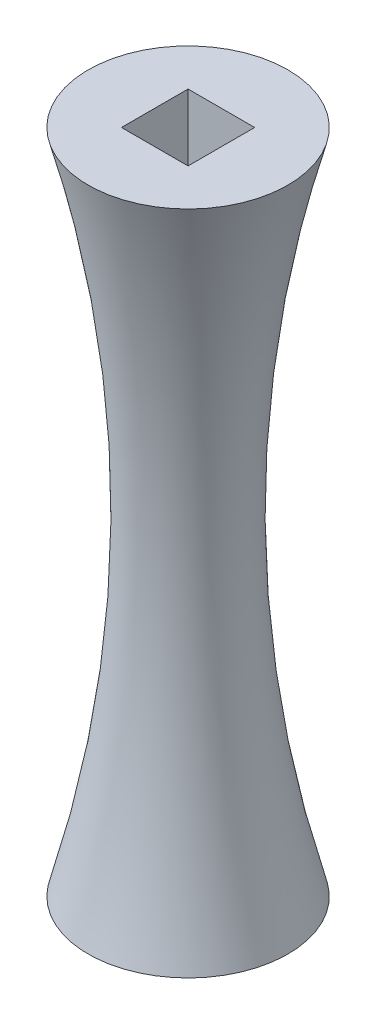
ISO-10303-21;
HEADER;
FILE_DESCRIPTION(('STEP AP214'),'2;1');
FILE_NAME('part.step','',(''),(''),'','','');
FILE_SCHEMA(('AUTOMOTIVE_DESIGN { 1 0 10303 214 1 1 1 1 }'));
ENDSEC;
DATA;
#1=APPLICATION_CONTEXT('core data for automotive mechanical design processes');
#2=APPLICATION_PROTOCOL_DEFINITION('international standard','automotive_design',2000,#1);
#3=PRODUCT_CONTEXT('',#1,'mechanical');
#4=PRODUCT('Part','Part','',(#3));
#5=PRODUCT_RELATED_PRODUCT_CATEGORY('part','',(#4));
#6=PRODUCT_DEFINITION_FORMATION('','',#4);
#7=PRODUCT_DEFINITION_CONTEXT('part definition',#1,'design');
#8=PRODUCT_DEFINITION('design','',#6,#7);
#9=PRODUCT_DEFINITION_SHAPE('','',#8);
#10=(LENGTH_UNIT() NAMED_UNIT(*) SI_UNIT(.MILLI.,.METRE.));
#11=(NAMED_UNIT(*) PLANE_ANGLE_UNIT() SI_UNIT($,.RADIAN.));
#12=(NAMED_UNIT(*) SI_UNIT($,.STERADIAN.) SOLID_ANGLE_UNIT());
#13=UNCERTAINTY_MEASURE_WITH_UNIT(LENGTH_MEASURE(1.E-05),#10,'distance_accuracy_value','');
#14=(GEOMETRIC_REPRESENTATION_CONTEXT(3) GLOBAL_UNCERTAINTY_ASSIGNED_CONTEXT((#13)) GLOBAL_UNIT_ASSIGNED_CONTEXT((#10,
#11,#12)) REPRESENTATION_CONTEXT('',''));
#15=CARTESIAN_POINT('',(0.,0.,0.));
#16=DIRECTION('',(0.,0.,1.));
#17=DIRECTION('',(1.,0.,0.));
#18=AXIS2_PLACEMENT_3D('',#15,#16,#17);
#19=CARTESIAN_POINT('',(0.,50.,0.));
#20=DIRECTION('',(0.,1.,0.));
#21=DIRECTION('',(0.,0.,1.));
#22=AXIS2_PLACEMENT_3D('',#19,#20,#21);
#23=PLANE('',#22);
#24=DIRECTION('',(0.,0.,-1.));
#25=VECTOR('',#24,1.);
#26=CARTESIAN_POINT('',(2.5,50.,-2.5));
#27=LINE('',#26,#25);
#28=CARTESIAN_POINT('',(2.5,50.,2.5));
#29=VERTEX_POINT('',#28);
#30=CARTESIAN_POINT('',(2.5,50.,-2.5));
#31=VERTEX_POINT('',#30);
#32=EDGE_CURVE('E60',#29,#31,#27,.T.);
#33=ORIENTED_EDGE('',*,*,#32,.F.);
#34=DIRECTION('',(1.,0.,0.));
#35=VECTOR('',#34,1.);
#36=CARTESIAN_POINT('',(-2.5,50.,2.5));
#37=LINE('',#36,#35);
#38=CARTESIAN_POINT('',(-2.5,50.,2.5));
#39=VERTEX_POINT('',#38);
#40=EDGE_CURVE('E147',#39,#29,#37,.T.);
#41=ORIENTED_EDGE('',*,*,#40,.F.);
#42=DIRECTION('',(0.,0.,1.));
#43=VECTOR('',#42,1.);
#44=CARTESIAN_POINT('',(-2.5,50.,-2.5));
#45=LINE('',#44,#43);
#46=CARTESIAN_POINT('',(-2.5,50.,-2.5));
#47=VERTEX_POINT('',#46);
#48=EDGE_CURVE('E160',#47,#39,#45,.T.);
#49=ORIENTED_EDGE('',*,*,#48,.F.);
#50=DIRECTION('',(-1.,0.,0.));
#51=VECTOR('',#50,1.);
#52=CARTESIAN_POINT('',(-2.5,50.,-2.5));
#53=LINE('',#52,#51);
#54=EDGE_CURVE('E157',#31,#47,#53,.T.);
#55=ORIENTED_EDGE('',*,*,#54,.F.);
#56=EDGE_LOOP('',(#33,#41,#49,#55));
#57=FACE_BOUND('',#56,.T.);
#58=CARTESIAN_POINT('',(0.,50.,0.));
#59=DIRECTION('',(0.,-1.,0.));
#60=DIRECTION('',(0.,0.,-1.));
#61=AXIS2_PLACEMENT_3D('',#58,#59,#60);
#62=CIRCLE('',#61,7.5);
#63=CARTESIAN_POINT('',(0.,50.,-7.5));
#64=VERTEX_POINT('',#63);
#65=EDGE_CURVE('E220',#64,#64,#62,.T.);
#66=ORIENTED_EDGE('',*,*,#65,.F.);
#67=EDGE_LOOP('',(#66));
#68=FACE_BOUND('',#67,.T.);
#69=ADVANCED_FACE('F36',(#57,#68),#23,.T.);
#70=CARTESIAN_POINT('',(2.5,40.,-2.5));
#71=DIRECTION('',(1.,0.,0.));
#72=DIRECTION('',(0.,0.,-1.));
#73=AXIS2_PLACEMENT_3D('',#70,#71,#72);
#74=PLANE('',#73);
#75=ORIENTED_EDGE('',*,*,#32,.T.);
#76=DIRECTION('',(0.,1.,0.));
#77=VECTOR('',#76,1.);
#78=CARTESIAN_POINT('',(2.5,40.,-2.5));
#79=LINE('',#78,#77);
#80=CARTESIAN_POINT('',(2.5,40.,-2.5));
#81=VERTEX_POINT('',#80);
#82=EDGE_CURVE('E40',#81,#31,#79,.T.);
#83=ORIENTED_EDGE('',*,*,#82,.F.);
#84=DIRECTION('',(0.,0.,-1.));
#85=VECTOR('',#84,1.);
#86=CARTESIAN_POINT('',(2.5,40.,-2.5));
#87=LINE('',#86,#85);
#88=CARTESIAN_POINT('',(2.5,40.,2.5));
#89=VERTEX_POINT('',#88);
#90=EDGE_CURVE('E143',#89,#81,#87,.T.);
#91=ORIENTED_EDGE('',*,*,#90,.F.);
#92=DIRECTION('',(0.,1.,0.));
#93=VECTOR('',#92,1.);
#94=CARTESIAN_POINT('',(2.5,40.,2.5));
#95=LINE('',#94,#93);
#96=EDGE_CURVE('E11',#89,#29,#95,.T.);
#97=ORIENTED_EDGE('',*,*,#96,.T.);
#98=EDGE_LOOP('',(#75,#83,#91,#97));
#99=FACE_BOUND('',#98,.T.);
#100=ADVANCED_FACE('F183',(#99),#74,.F.);
#101=CARTESIAN_POINT('',(-2.5,40.,2.5));
#102=DIRECTION('',(0.,0.,1.));
#103=DIRECTION('',(1.,0.,0.));
#104=AXIS2_PLACEMENT_3D('',#101,#102,#103);
#105=PLANE('',#104);
#106=ORIENTED_EDGE('',*,*,#40,.T.);
#107=ORIENTED_EDGE('',*,*,#96,.F.);
#108=DIRECTION('',(1.,0.,0.));
#109=VECTOR('',#108,1.);
#110=CARTESIAN_POINT('',(-2.5,40.,2.5));
#111=LINE('',#110,#109);
#112=CARTESIAN_POINT('',(-2.5,40.,2.5));
#113=VERTEX_POINT('',#112);
#114=EDGE_CURVE('E153',#113,#89,#111,.T.);
#115=ORIENTED_EDGE('',*,*,#114,.F.);
#116=DIRECTION('',(0.,1.,0.));
#117=VECTOR('',#116,1.);
#118=CARTESIAN_POINT('',(-2.5,40.,2.5));
#119=LINE('',#118,#117);
#120=EDGE_CURVE('E45',#113,#39,#119,.T.);
#121=ORIENTED_EDGE('',*,*,#120,.T.);
#122=EDGE_LOOP('',(#106,#107,#115,#121));
#123=FACE_BOUND('',#122,.T.);
#124=ADVANCED_FACE('F182',(#123),#105,.F.);
#125=CARTESIAN_POINT('',(-2.5,40.,-2.5));
#126=DIRECTION('',(-1.,0.,0.));
#127=DIRECTION('',(0.,0.,1.));
#128=AXIS2_PLACEMENT_3D('',#125,#126,#127);
#129=PLANE('',#128);
#130=ORIENTED_EDGE('',*,*,#48,.T.);
#131=ORIENTED_EDGE('',*,*,#120,.F.);
#132=DIRECTION('',(0.,0.,1.));
#133=VECTOR('',#132,1.);
#134=CARTESIAN_POINT('',(-2.5,40.,-2.5));
#135=LINE('',#134,#133);
#136=CARTESIAN_POINT('',(-2.5,40.,-2.5));
#137=VERTEX_POINT('',#136);
#138=EDGE_CURVE('E150',#137,#113,#135,.T.);
#139=ORIENTED_EDGE('',*,*,#138,.F.);
#140=DIRECTION('',(0.,1.,0.));
#141=VECTOR('',#140,1.);
#142=CARTESIAN_POINT('',(-2.5,40.,-2.5));
#143=LINE('',#142,#141);
#144=EDGE_CURVE('E165',#137,#47,#143,.T.);
#145=ORIENTED_EDGE('',*,*,#144,.T.);
#146=EDGE_LOOP('',(#130,#131,#139,#145));
#147=FACE_BOUND('',#146,.T.);
#148=ADVANCED_FACE('F177',(#147),#129,.F.);
#149=CARTESIAN_POINT('',(-2.5,40.,-2.5));
#150=DIRECTION('',(0.,0.,-1.));
#151=DIRECTION('',(-1.,0.,0.));
#152=AXIS2_PLACEMENT_3D('',#149,#150,#151);
#153=PLANE('',#152);
#154=ORIENTED_EDGE('',*,*,#54,.T.);
#155=ORIENTED_EDGE('',*,*,#144,.F.);
#156=DIRECTION('',(-1.,0.,0.));
#157=VECTOR('',#156,1.);
#158=CARTESIAN_POINT('',(-2.5,40.,-2.5));
#159=LINE('',#158,#157);
#160=EDGE_CURVE('E146',#81,#137,#159,.T.);
#161=ORIENTED_EDGE('',*,*,#160,.F.);
#162=ORIENTED_EDGE('',*,*,#82,.T.);
#163=EDGE_LOOP('',(#154,#155,#161,#162));
#164=FACE_BOUND('',#163,.T.);
#165=ADVANCED_FACE('F171',(#164),#153,.F.);
#166=CARTESIAN_POINT('',(0.,40.,0.));
#167=DIRECTION('',(0.,1.,0.));
#168=DIRECTION('',(0.,0.,1.));
#169=AXIS2_PLACEMENT_3D('',#166,#167,#168);
#170=PLANE('',#169);
#171=ORIENTED_EDGE('',*,*,#90,.T.);
#172=ORIENTED_EDGE('',*,*,#160,.T.);
#173=ORIENTED_EDGE('',*,*,#138,.T.);
#174=ORIENTED_EDGE('',*,*,#114,.T.);
#175=EDGE_LOOP('',(#171,#172,#173,#174));
#176=FACE_BOUND('',#175,.T.);
#177=ADVANCED_FACE('F181',(#176),#170,.T.);
#178=CARTESIAN_POINT('',(0.,25.,0.));
#179=DIRECTION('',(0.,-1.,0.));
#180=DIRECTION('',(0.,0.,-1.));
#181=AXIS2_PLACEMENT_3D('',#178,#179,#180);
#182=TOROIDAL_SURFACE('',#181,97.5,93.407708461347);
#183=ORIENTED_EDGE('',*,*,#65,.T.);
#184=EDGE_LOOP('',(#183));
#185=FACE_BOUND('',#184,.T.);
#186=CARTESIAN_POINT('',(0.,0.,0.));
#187=DIRECTION('',(0.,-1.,0.));
#188=DIRECTION('',(0.,0.,-1.));
#189=AXIS2_PLACEMENT_3D('',#186,#187,#188);
#190=CIRCLE('',#189,7.5);
#191=CARTESIAN_POINT('',(0.,0.,-7.5));
#192=VERTEX_POINT('',#191);
#193=EDGE_CURVE('E128',#192,#192,#190,.T.);
#194=ORIENTED_EDGE('',*,*,#193,.F.);
#195=EDGE_LOOP('',(#194));
#196=FACE_BOUND('',#195,.T.);
#197=ADVANCED_FACE('F198',(#185,#196),#182,.F.);
#198=CARTESIAN_POINT('',(0.,10.,0.));
#199=DIRECTION('',(0.,-1.,0.));
#200=DIRECTION('',(0.,0.,-1.));
#201=AXIS2_PLACEMENT_3D('',#198,#199,#200);
#202=PLANE('',#201);
#203=DIRECTION('',(0.,0.,-1.));
#204=VECTOR('',#203,1.);
#205=CARTESIAN_POINT('',(-2.5,10.,2.5));
#206=LINE('',#205,#204);
#207=CARTESIAN_POINT('',(-2.5,10.,2.5));
#208=VERTEX_POINT('',#207);
#209=CARTESIAN_POINT('',(-2.5,10.,-2.5));
#210=VERTEX_POINT('',#209);
#211=EDGE_CURVE('E104',#208,#210,#206,.T.);
#212=ORIENTED_EDGE('',*,*,#211,.T.);
#213=DIRECTION('',(1.,0.,0.));
#214=VECTOR('',#213,1.);
#215=CARTESIAN_POINT('',(-2.5,10.,-2.5));
#216=LINE('',#215,#214);
#217=CARTESIAN_POINT('',(2.5,10.,-2.5));
#218=VERTEX_POINT('',#217);
#219=EDGE_CURVE('E113',#210,#218,#216,.T.);
#220=ORIENTED_EDGE('',*,*,#219,.T.);
#221=DIRECTION('',(0.,0.,1.));
#222=VECTOR('',#221,1.);
#223=CARTESIAN_POINT('',(2.5,10.,2.5));
#224=LINE('',#223,#222);
#225=CARTESIAN_POINT('',(2.5,10.,2.5));
#226=VERTEX_POINT('',#225);
#227=EDGE_CURVE('E118',#218,#226,#224,.T.);
#228=ORIENTED_EDGE('',*,*,#227,.T.);
#229=DIRECTION('',(-1.,0.,0.));
#230=VECTOR('',#229,1.);
#231=CARTESIAN_POINT('',(-2.5,10.,2.5));
#232=LINE('',#231,#230);
#233=EDGE_CURVE('E110',#226,#208,#232,.T.);
#234=ORIENTED_EDGE('',*,*,#233,.T.);
#235=EDGE_LOOP('',(#212,#220,#228,#234));
#236=FACE_BOUND('',#235,.T.);
#237=ADVANCED_FACE('F120',(#236),#202,.T.);
#238=CARTESIAN_POINT('',(2.5,10.,2.5));
#239=DIRECTION('',(1.,0.,0.));
#240=DIRECTION('',(0.,0.,-1.));
#241=AXIS2_PLACEMENT_3D('',#238,#239,#240);
#242=PLANE('',#241);
#243=DIRECTION('',(0.,0.,1.));
#244=VECTOR('',#243,1.);
#245=CARTESIAN_POINT('',(2.5,0.,2.5));
#246=LINE('',#245,#244);
#247=CARTESIAN_POINT('',(2.5,0.,-2.5));
#248=VERTEX_POINT('',#247);
#249=CARTESIAN_POINT('',(2.5,0.,2.5));
#250=VERTEX_POINT('',#249);
#251=EDGE_CURVE('E125',#248,#250,#246,.T.);
#252=ORIENTED_EDGE('',*,*,#251,.T.);
#253=DIRECTION('',(0.,-1.,0.));
#254=VECTOR('',#253,1.);
#255=CARTESIAN_POINT('',(2.5,10.,2.5));
#256=LINE('',#255,#254);
#257=EDGE_CURVE('E140',#226,#250,#256,.T.);
#258=ORIENTED_EDGE('',*,*,#257,.F.);
#259=ORIENTED_EDGE('',*,*,#227,.F.);
#260=DIRECTION('',(0.,-1.,0.));
#261=VECTOR('',#260,1.);
#262=CARTESIAN_POINT('',(2.5,10.,-2.5));
#263=LINE('',#262,#261);
#264=EDGE_CURVE('E109',#218,#248,#263,.T.);
#265=ORIENTED_EDGE('',*,*,#264,.T.);
#266=EDGE_LOOP('',(#252,#258,#259,#265));
#267=FACE_BOUND('',#266,.T.);
#268=ADVANCED_FACE('F204',(#267),#242,.F.);
#269=CARTESIAN_POINT('',(-2.5,10.,2.5));
#270=DIRECTION('',(0.,0.,1.));
#271=DIRECTION('',(1.,0.,0.));
#272=AXIS2_PLACEMENT_3D('',#269,#270,#271);
#273=PLANE('',#272);
#274=DIRECTION('',(-1.,0.,0.));
#275=VECTOR('',#274,1.);
#276=CARTESIAN_POINT('',(-2.5,0.,2.5));
#277=LINE('',#276,#275);
#278=CARTESIAN_POINT('',(-2.5,0.,2.5));
#279=VERTEX_POINT('',#278);
#280=EDGE_CURVE('E122',#250,#279,#277,.T.);
#281=ORIENTED_EDGE('',*,*,#280,.T.);
#282=DIRECTION('',(0.,-1.,0.));
#283=VECTOR('',#282,1.);
#284=CARTESIAN_POINT('',(-2.5,10.,2.5));
#285=LINE('',#284,#283);
#286=EDGE_CURVE('E138',#208,#279,#285,.T.);
#287=ORIENTED_EDGE('',*,*,#286,.F.);
#288=ORIENTED_EDGE('',*,*,#233,.F.);
#289=ORIENTED_EDGE('',*,*,#257,.T.);
#290=EDGE_LOOP('',(#281,#287,#288,#289));
#291=FACE_BOUND('',#290,.T.);
#292=ADVANCED_FACE('F201',(#291),#273,.F.);
#293=CARTESIAN_POINT('',(-2.5,10.,2.5));
#294=DIRECTION('',(-1.,0.,0.));
#295=DIRECTION('',(0.,0.,1.));
#296=AXIS2_PLACEMENT_3D('',#293,#294,#295);
#297=PLANE('',#296);
#298=DIRECTION('',(0.,0.,-1.));
#299=VECTOR('',#298,1.);
#300=CARTESIAN_POINT('',(-2.5,0.,2.5));
#301=LINE('',#300,#299);
#302=CARTESIAN_POINT('',(-2.5,0.,-2.5));
#303=VERTEX_POINT('',#302);
#304=EDGE_CURVE('E53',#279,#303,#301,.T.);
#305=ORIENTED_EDGE('',*,*,#304,.T.);
#306=DIRECTION('',(0.,-1.,0.));
#307=VECTOR('',#306,1.);
#308=CARTESIAN_POINT('',(-2.5,10.,-2.5));
#309=LINE('',#308,#307);
#310=EDGE_CURVE('E100',#210,#303,#309,.T.);
#311=ORIENTED_EDGE('',*,*,#310,.F.);
#312=ORIENTED_EDGE('',*,*,#211,.F.);
#313=ORIENTED_EDGE('',*,*,#286,.T.);
#314=EDGE_LOOP('',(#305,#311,#312,#313));
#315=FACE_BOUND('',#314,.T.);
#316=ADVANCED_FACE('F102',(#315),#297,.F.);
#317=CARTESIAN_POINT('',(-2.5,10.,-2.5));
#318=DIRECTION('',(0.,0.,-1.));
#319=DIRECTION('',(-1.,0.,0.));
#320=AXIS2_PLACEMENT_3D('',#317,#318,#319);
#321=PLANE('',#320);
#322=DIRECTION('',(1.,0.,0.));
#323=VECTOR('',#322,1.);
#324=CARTESIAN_POINT('',(-2.5,0.,-2.5));
#325=LINE('',#324,#323);
#326=EDGE_CURVE('E134',#303,#248,#325,.T.);
#327=ORIENTED_EDGE('',*,*,#326,.T.);
#328=ORIENTED_EDGE('',*,*,#264,.F.);
#329=ORIENTED_EDGE('',*,*,#219,.F.);
#330=ORIENTED_EDGE('',*,*,#310,.T.);
#331=EDGE_LOOP('',(#327,#328,#329,#330));
#332=FACE_BOUND('',#331,.T.);
#333=ADVANCED_FACE('F114',(#332),#321,.F.);
#334=CARTESIAN_POINT('',(0.,0.,0.));
#335=DIRECTION('',(0.,1.,0.));
#336=DIRECTION('',(0.,0.,1.));
#337=AXIS2_PLACEMENT_3D('',#334,#335,#336);
#338=PLANE('',#337);
#339=ORIENTED_EDGE('',*,*,#326,.F.);
#340=ORIENTED_EDGE('',*,*,#304,.F.);
#341=ORIENTED_EDGE('',*,*,#280,.F.);
#342=ORIENTED_EDGE('',*,*,#251,.F.);
#343=EDGE_LOOP('',(#339,#340,#341,#342));
#344=FACE_BOUND('',#343,.T.);
#345=ORIENTED_EDGE('',*,*,#193,.T.);
#346=EDGE_LOOP('',(#345));
#347=FACE_BOUND('',#346,.T.);
#348=ADVANCED_FACE('F38',(#344,#347),#338,.F.);
#349=CLOSED_SHELL('',(#69,#100,#124,#148,#165,#177,#197,#237,#268,#292,#316,#333,#348));
#350=MANIFOLD_SOLID_BREP('B2',#349);
#351=ADVANCED_BREP_SHAPE_REPRESENTATION('',(#18,#350),#14);
#352=SHAPE_DEFINITION_REPRESENTATION(#9,#351);
ENDSEC;
END-ISO-10303-21;
